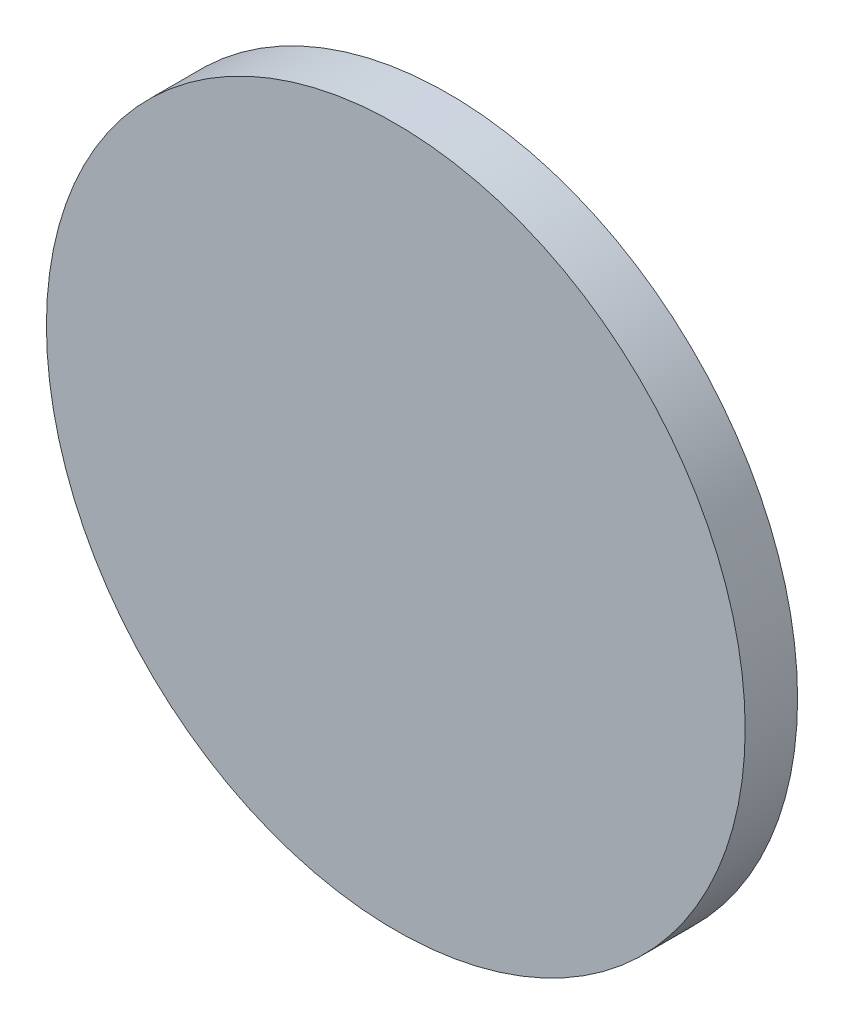
ISO-10303-21;
HEADER;
FILE_DESCRIPTION(('STEP AP214'),'2;1');
FILE_NAME('part.step','',(''),(''),'','','');
FILE_SCHEMA(('AUTOMOTIVE_DESIGN { 1 0 10303 214 1 1 1 1 }'));
ENDSEC;
DATA;
#1=APPLICATION_CONTEXT('core data for automotive mechanical design processes');
#2=APPLICATION_PROTOCOL_DEFINITION('international standard','automotive_design',2000,#1);
#3=PRODUCT_CONTEXT('',#1,'mechanical');
#4=PRODUCT('Part','Part','',(#3));
#5=PRODUCT_RELATED_PRODUCT_CATEGORY('part','',(#4));
#6=PRODUCT_DEFINITION_FORMATION('','',#4);
#7=PRODUCT_DEFINITION_CONTEXT('part definition',#1,'design');
#8=PRODUCT_DEFINITION('design','',#6,#7);
#9=PRODUCT_DEFINITION_SHAPE('','',#8);
#10=(LENGTH_UNIT() NAMED_UNIT(*) SI_UNIT(.MILLI.,.METRE.));
#11=(NAMED_UNIT(*) PLANE_ANGLE_UNIT() SI_UNIT($,.RADIAN.));
#12=(NAMED_UNIT(*) SI_UNIT($,.STERADIAN.) SOLID_ANGLE_UNIT());
#13=UNCERTAINTY_MEASURE_WITH_UNIT(LENGTH_MEASURE(1.E-05),#10,'distance_accuracy_value','');
#14=(GEOMETRIC_REPRESENTATION_CONTEXT(3) GLOBAL_UNCERTAINTY_ASSIGNED_CONTEXT((#13)) GLOBAL_UNIT_ASSIGNED_CONTEXT((#10,
#11,#12)) REPRESENTATION_CONTEXT('',''));
#15=CARTESIAN_POINT('',(0.,0.,0.));
#16=DIRECTION('',(0.,0.,1.));
#17=DIRECTION('',(1.,0.,0.));
#18=AXIS2_PLACEMENT_3D('',#15,#16,#17);
#19=CARTESIAN_POINT('',(8.34916,16.03491,0.79916));
#20=DIRECTION('',(0.,0.,1.));
#21=DIRECTION('',(1.,0.,0.));
#22=AXIS2_PLACEMENT_3D('',#19,#20,#21);
#23=PLANE('',#22);
#24=CARTESIAN_POINT('',(8.34916,16.03491,0.79916));
#25=DIRECTION('',(0.,0.,1.));
#26=DIRECTION('',(1.,0.,0.));
#27=AXIS2_PLACEMENT_3D('',#24,#25,#26);
#28=CIRCLE('',#27,0.2286);
#29=CARTESIAN_POINT('',(8.57776,16.03491,0.79916));
#30=VERTEX_POINT('',#29);
#31=EDGE_CURVE('E18',#30,#30,#28,.F.);
#32=ORIENTED_EDGE('',*,*,#31,.F.);
#33=EDGE_LOOP('',(#32));
#34=FACE_BOUND('',#33,.T.);
#35=ADVANCED_FACE('F15',(#34),#23,.T.);
#36=CARTESIAN_POINT('',(8.34916,16.03491,0.76487));
#37=DIRECTION('',(0.,0.,1.));
#38=DIRECTION('',(1.,0.,0.));
#39=AXIS2_PLACEMENT_3D('',#36,#37,#38);
#40=CYLINDRICAL_SURFACE('',#39,0.2286);
#41=ORIENTED_EDGE('',*,*,#31,.T.);
#42=EDGE_LOOP('',(#41));
#43=FACE_BOUND('',#42,.T.);
#44=CARTESIAN_POINT('',(8.34916,16.03491,0.76487));
#45=DIRECTION('',(0.,0.,1.));
#46=DIRECTION('',(1.,0.,0.));
#47=AXIS2_PLACEMENT_3D('',#44,#45,#46);
#48=CIRCLE('',#47,0.2286);
#49=CARTESIAN_POINT('',(8.57776,16.03491,0.76487));
#50=VERTEX_POINT('',#49);
#51=EDGE_CURVE('E10',#50,#50,#48,.F.);
#52=ORIENTED_EDGE('',*,*,#51,.F.);
#53=EDGE_LOOP('',(#52));
#54=FACE_BOUND('',#53,.T.);
#55=ADVANCED_FACE('F27',(#43,#54),#40,.T.);
#56=CARTESIAN_POINT('',(8.34916,16.03491,0.76487));
#57=DIRECTION('',(0.,0.,-1.));
#58=DIRECTION('',(-1.,0.,0.));
#59=AXIS2_PLACEMENT_3D('',#56,#57,#58);
#60=PLANE('',#59);
#61=ORIENTED_EDGE('',*,*,#51,.T.);
#62=EDGE_LOOP('',(#61));
#63=FACE_BOUND('',#62,.T.);
#64=ADVANCED_FACE('F35',(#63),#60,.T.);
#65=CLOSED_SHELL('',(#35,#55,#64));
#66=MANIFOLD_SOLID_BREP('B1',#65);
#67=ADVANCED_BREP_SHAPE_REPRESENTATION('',(#18,#66),#14);
#68=SHAPE_DEFINITION_REPRESENTATION(#9,#67);
ENDSEC;
END-ISO-10303-21;
